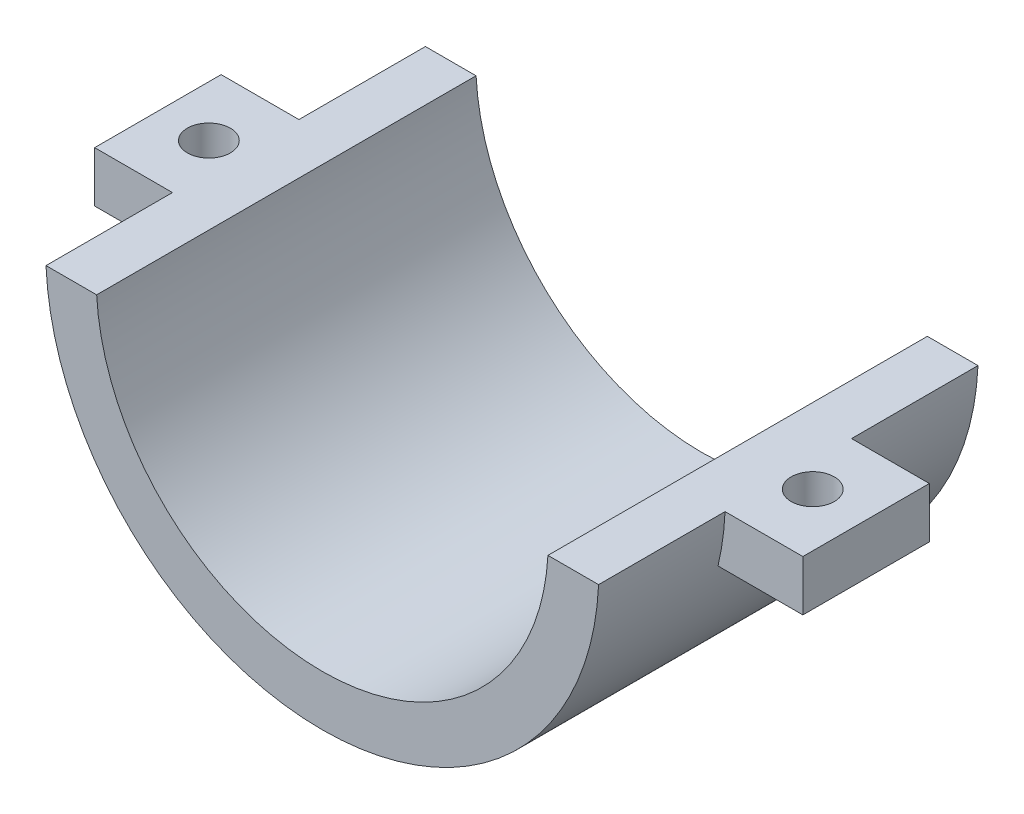
ISO-10303-21;
HEADER;
FILE_DESCRIPTION(('STEP AP214'),'2;1');
FILE_NAME('part.step','',(''),(''),'','','');
FILE_SCHEMA(('AUTOMOTIVE_DESIGN { 1 0 10303 214 1 1 1 1 }'));
ENDSEC;
DATA;
#1=APPLICATION_CONTEXT('core data for automotive mechanical design processes');
#2=APPLICATION_PROTOCOL_DEFINITION('international standard','automotive_design',2000,#1);
#3=PRODUCT_CONTEXT('',#1,'mechanical');
#4=PRODUCT('Part','Part','',(#3));
#5=PRODUCT_RELATED_PRODUCT_CATEGORY('part','',(#4));
#6=PRODUCT_DEFINITION_FORMATION('','',#4);
#7=PRODUCT_DEFINITION_CONTEXT('part definition',#1,'design');
#8=PRODUCT_DEFINITION('design','',#6,#7);
#9=PRODUCT_DEFINITION_SHAPE('','',#8);
#10=(LENGTH_UNIT() NAMED_UNIT(*) SI_UNIT(.MILLI.,.METRE.));
#11=(NAMED_UNIT(*) PLANE_ANGLE_UNIT() SI_UNIT($,.RADIAN.));
#12=(NAMED_UNIT(*) SI_UNIT($,.STERADIAN.) SOLID_ANGLE_UNIT());
#13=UNCERTAINTY_MEASURE_WITH_UNIT(LENGTH_MEASURE(1.E-05),#10,'distance_accuracy_value','');
#14=(GEOMETRIC_REPRESENTATION_CONTEXT(3) GLOBAL_UNCERTAINTY_ASSIGNED_CONTEXT((#13)) GLOBAL_UNIT_ASSIGNED_CONTEXT((#10,
#11,#12)) REPRESENTATION_CONTEXT('',''));
#15=CARTESIAN_POINT('',(0.,0.,0.));
#16=DIRECTION('',(0.,0.,1.));
#17=DIRECTION('',(1.,0.,0.));
#18=AXIS2_PLACEMENT_3D('',#15,#16,#17);
#19=CARTESIAN_POINT('',(0.,0.,-19.6210465312143));
#20=DIRECTION('',(0.,0.,-1.));
#21=DIRECTION('',(-1.,0.,0.));
#22=AXIS2_PLACEMENT_3D('',#19,#20,#21);
#23=CYLINDRICAL_SURFACE('',#22,21.87);
#24=CARTESIAN_POINT('',(0.,0.,-15.));
#25=DIRECTION('',(0.,0.,-1.));
#26=DIRECTION('',(-1.,0.,0.));
#27=AXIS2_PLACEMENT_3D('',#24,#25,#26);
#28=CIRCLE('',#27,21.87);
#29=CARTESIAN_POINT('',(21.8471256690669,-0.999999999999997,-15.));
#30=VERTEX_POINT('',#29);
#31=CARTESIAN_POINT('',(-21.8471256690669,-0.999999999999997,-15.));
#32=VERTEX_POINT('',#31);
#33=EDGE_CURVE('E206',#30,#32,#28,.T.);
#34=ORIENTED_EDGE('',*,*,#33,.F.);
#35=DIRECTION('',(0.,0.,-1.));
#36=VECTOR('',#35,1.);
#37=CARTESIAN_POINT('',(21.8471256690669,-0.999999999999997,-19.6210465312143));
#38=LINE('',#37,#36);
#39=CARTESIAN_POINT('',(21.8471256690669,-0.999999999999997,-5.));
#40=VERTEX_POINT('',#39);
#41=EDGE_CURVE('E286',#30,#40,#38,.F.);
#42=ORIENTED_EDGE('',*,*,#41,.T.);
#43=CARTESIAN_POINT('',(0.,0.,-5.));
#44=DIRECTION('',(0.,0.,1.));
#45=DIRECTION('',(1.,0.,0.));
#46=AXIS2_PLACEMENT_3D('',#43,#44,#45);
#47=CIRCLE('',#46,21.87);
#48=CARTESIAN_POINT('',(21.2907703007665,-4.99999999999999,-5.));
#49=VERTEX_POINT('',#48);
#50=EDGE_CURVE('E171',#40,#49,#47,.F.);
#51=ORIENTED_EDGE('',*,*,#50,.T.);
#52=DIRECTION('',(0.,0.,-1.));
#53=VECTOR('',#52,1.);
#54=CARTESIAN_POINT('',(21.2907703007665,-4.99999999999999,-19.6210465312143));
#55=LINE('',#54,#53);
#56=CARTESIAN_POINT('',(21.2907703007665,-4.99999999999999,4.99999999999999));
#57=VERTEX_POINT('',#56);
#58=EDGE_CURVE('E11',#57,#49,#55,.T.);
#59=ORIENTED_EDGE('',*,*,#58,.F.);
#60=CARTESIAN_POINT('',(0.,0.,4.99999999999999));
#61=DIRECTION('',(0.,0.,1.));
#62=DIRECTION('',(1.,0.,0.));
#63=AXIS2_PLACEMENT_3D('',#60,#61,#62);
#64=CIRCLE('',#63,21.87);
#65=CARTESIAN_POINT('',(21.8471256690669,-0.999999999999997,4.99999999999999));
#66=VERTEX_POINT('',#65);
#67=EDGE_CURVE('E168',#66,#57,#64,.F.);
#68=ORIENTED_EDGE('',*,*,#67,.F.);
#69=CARTESIAN_POINT('',(21.8471256690669,-0.999999999999997,15.));
#70=VERTEX_POINT('',#69);
#71=EDGE_CURVE('E64',#66,#70,#38,.F.);
#72=ORIENTED_EDGE('',*,*,#71,.T.);
#73=CARTESIAN_POINT('',(0.,0.,15.));
#74=DIRECTION('',(0.,0.,-1.));
#75=DIRECTION('',(-1.,0.,0.));
#76=AXIS2_PLACEMENT_3D('',#73,#74,#75);
#77=CIRCLE('',#76,21.87);
#78=CARTESIAN_POINT('',(-21.8471256690669,-0.999999999999997,15.));
#79=VERTEX_POINT('',#78);
#80=EDGE_CURVE('E202',#70,#79,#77,.T.);
#81=ORIENTED_EDGE('',*,*,#80,.T.);
#82=DIRECTION('',(0.,0.,-1.));
#83=VECTOR('',#82,1.);
#84=CARTESIAN_POINT('',(-21.8471256690669,-0.999999999999997,-19.6210465312143));
#85=LINE('',#84,#83);
#86=CARTESIAN_POINT('',(-21.8471256690669,-0.999999999999997,4.99999999999999));
#87=VERTEX_POINT('',#86);
#88=EDGE_CURVE('E228',#79,#87,#85,.T.);
#89=ORIENTED_EDGE('',*,*,#88,.T.);
#90=CARTESIAN_POINT('',(0.,0.,4.99999999999999));
#91=DIRECTION('',(0.,0.,-1.));
#92=DIRECTION('',(-1.,0.,0.));
#93=AXIS2_PLACEMENT_3D('',#90,#91,#92);
#94=CIRCLE('',#93,21.87);
#95=CARTESIAN_POINT('',(-21.2907703007665,-5.,4.99999999999999));
#96=VERTEX_POINT('',#95);
#97=EDGE_CURVE('E192',#87,#96,#94,.F.);
#98=ORIENTED_EDGE('',*,*,#97,.T.);
#99=DIRECTION('',(0.,0.,-1.));
#100=VECTOR('',#99,1.);
#101=CARTESIAN_POINT('',(-21.2907703007665,-5.,-19.6210465312143));
#102=LINE('',#101,#100);
#103=CARTESIAN_POINT('',(-21.2907703007665,-5.,-5.));
#104=VERTEX_POINT('',#103);
#105=EDGE_CURVE('E49',#104,#96,#102,.F.);
#106=ORIENTED_EDGE('',*,*,#105,.F.);
#107=CARTESIAN_POINT('',(0.,0.,-5.));
#108=DIRECTION('',(0.,0.,-1.));
#109=DIRECTION('',(-1.,0.,0.));
#110=AXIS2_PLACEMENT_3D('',#107,#108,#109);
#111=CIRCLE('',#110,21.87);
#112=CARTESIAN_POINT('',(-21.8471256690669,-0.999999999999997,-5.));
#113=VERTEX_POINT('',#112);
#114=EDGE_CURVE('E195',#113,#104,#111,.F.);
#115=ORIENTED_EDGE('',*,*,#114,.F.);
#116=EDGE_CURVE('E250',#113,#32,#85,.T.);
#117=ORIENTED_EDGE('',*,*,#116,.T.);
#118=EDGE_LOOP('',(#34,#42,#51,#59,#68,#72,#81,#89,#98,#106,#115,#117));
#119=FACE_BOUND('',#118,.T.);
#120=ADVANCED_FACE('F39',(#119),#23,.T.);
#121=CARTESIAN_POINT('',(0.,0.,-19.6210465312143));
#122=DIRECTION('',(0.,0.,-1.));
#123=DIRECTION('',(-1.,0.,0.));
#124=AXIS2_PLACEMENT_3D('',#121,#122,#123);
#125=CYLINDRICAL_SURFACE('',#124,17.87);
#126=CARTESIAN_POINT('',(0.,0.,15.));
#127=DIRECTION('',(0.,0.,-1.));
#128=DIRECTION('',(-1.,0.,0.));
#129=AXIS2_PLACEMENT_3D('',#126,#127,#128);
#130=CIRCLE('',#129,17.87);
#131=CARTESIAN_POINT('',(17.841998206479,-0.999999999999997,15.));
#132=VERTEX_POINT('',#131);
#133=CARTESIAN_POINT('',(-17.841998206479,-0.999999999999997,15.));
#134=VERTEX_POINT('',#133);
#135=EDGE_CURVE('E198',#132,#134,#130,.T.);
#136=ORIENTED_EDGE('',*,*,#135,.F.);
#137=DIRECTION('',(0.,0.,-1.));
#138=VECTOR('',#137,1.);
#139=CARTESIAN_POINT('',(17.841998206479,-0.999999999999997,-19.6210465312143));
#140=LINE('',#139,#138);
#141=CARTESIAN_POINT('',(17.841998206479,-0.999999999999997,-15.));
#142=VERTEX_POINT('',#141);
#143=EDGE_CURVE('E284',#132,#142,#140,.T.);
#144=ORIENTED_EDGE('',*,*,#143,.T.);
#145=CARTESIAN_POINT('',(0.,0.,-15.));
#146=DIRECTION('',(0.,0.,-1.));
#147=DIRECTION('',(-1.,0.,0.));
#148=AXIS2_PLACEMENT_3D('',#145,#146,#147);
#149=CIRCLE('',#148,17.87);
#150=CARTESIAN_POINT('',(-17.841998206479,-0.999999999999997,-15.));
#151=VERTEX_POINT('',#150);
#152=EDGE_CURVE('E210',#142,#151,#149,.T.);
#153=ORIENTED_EDGE('',*,*,#152,.T.);
#154=DIRECTION('',(0.,0.,-1.));
#155=VECTOR('',#154,1.);
#156=CARTESIAN_POINT('',(-17.841998206479,-0.999999999999997,-19.6210465312143));
#157=LINE('',#156,#155);
#158=EDGE_CURVE('E246',#151,#134,#157,.F.);
#159=ORIENTED_EDGE('',*,*,#158,.T.);
#160=EDGE_LOOP('',(#136,#144,#153,#159));
#161=FACE_BOUND('',#160,.T.);
#162=ADVANCED_FACE('F303',(#161),#125,.F.);
#163=CARTESIAN_POINT('',(21.87,1.52717393760999E-13,-15.));
#164=DIRECTION('',(0.,0.,-1.));
#165=DIRECTION('',(-1.,0.,0.));
#166=AXIS2_PLACEMENT_3D('',#163,#164,#165);
#167=PLANE('',#166);
#168=ORIENTED_EDGE('',*,*,#33,.T.);
#169=DIRECTION('',(1.,0.,0.));
#170=VECTOR('',#169,1.);
#171=CARTESIAN_POINT('',(21.87,-0.999999999999997,-15.));
#172=LINE('',#171,#170);
#173=EDGE_CURVE('E259',#32,#151,#172,.T.);
#174=ORIENTED_EDGE('',*,*,#173,.T.);
#175=ORIENTED_EDGE('',*,*,#152,.F.);
#176=EDGE_CURVE('E291',#142,#30,#172,.T.);
#177=ORIENTED_EDGE('',*,*,#176,.T.);
#178=EDGE_LOOP('',(#168,#174,#175,#177));
#179=FACE_BOUND('',#178,.T.);
#180=ADVANCED_FACE('F41',(#179),#167,.T.);
#181=CARTESIAN_POINT('',(21.87,1.52717393760999E-13,15.));
#182=DIRECTION('',(0.,0.,1.));
#183=DIRECTION('',(1.,0.,0.));
#184=AXIS2_PLACEMENT_3D('',#181,#182,#183);
#185=PLANE('',#184);
#186=ORIENTED_EDGE('',*,*,#80,.F.);
#187=DIRECTION('',(-1.,0.,0.));
#188=VECTOR('',#187,1.);
#189=CARTESIAN_POINT('',(21.87,-0.999999999999997,15.));
#190=LINE('',#189,#188);
#191=EDGE_CURVE('E248',#70,#132,#190,.T.);
#192=ORIENTED_EDGE('',*,*,#191,.T.);
#193=ORIENTED_EDGE('',*,*,#135,.T.);
#194=EDGE_CURVE('E241',#134,#79,#190,.T.);
#195=ORIENTED_EDGE('',*,*,#194,.T.);
#196=EDGE_LOOP('',(#186,#192,#193,#195));
#197=FACE_BOUND('',#196,.T.);
#198=ADVANCED_FACE('F306',(#197),#185,.T.);
#199=CARTESIAN_POINT('',(-28.,0.,-5.));
#200=DIRECTION('',(-1.,0.,0.));
#201=DIRECTION('',(0.,0.,1.));
#202=AXIS2_PLACEMENT_3D('',#199,#200,#201);
#203=PLANE('',#202);
#204=DIRECTION('',(0.,-1.,0.));
#205=VECTOR('',#204,1.);
#206=CARTESIAN_POINT('',(-28.,0.,4.99999999999999));
#207=LINE('',#206,#205);
#208=CARTESIAN_POINT('',(-28.,-0.999999999999997,4.99999999999999));
#209=VERTEX_POINT('',#208);
#210=CARTESIAN_POINT('',(-28.,-5.,4.99999999999999));
#211=VERTEX_POINT('',#210);
#212=EDGE_CURVE('E174',#209,#211,#207,.T.);
#213=ORIENTED_EDGE('',*,*,#212,.F.);
#214=DIRECTION('',(0.,0.,-1.));
#215=VECTOR('',#214,1.);
#216=CARTESIAN_POINT('',(-28.,-0.999999999999997,-5.));
#217=LINE('',#216,#215);
#218=CARTESIAN_POINT('',(-28.,-0.999999999999997,-5.));
#219=VERTEX_POINT('',#218);
#220=EDGE_CURVE('E56',#209,#219,#217,.T.);
#221=ORIENTED_EDGE('',*,*,#220,.T.);
#222=DIRECTION('',(0.,-1.,0.));
#223=VECTOR('',#222,1.);
#224=CARTESIAN_POINT('',(-28.,0.,-5.));
#225=LINE('',#224,#223);
#226=CARTESIAN_POINT('',(-28.,-5.,-5.));
#227=VERTEX_POINT('',#226);
#228=EDGE_CURVE('E181',#219,#227,#225,.T.);
#229=ORIENTED_EDGE('',*,*,#228,.T.);
#230=DIRECTION('',(0.,0.,1.));
#231=VECTOR('',#230,1.);
#232=CARTESIAN_POINT('',(-28.,-5.,-5.));
#233=LINE('',#232,#231);
#234=EDGE_CURVE('E188',#227,#211,#233,.T.);
#235=ORIENTED_EDGE('',*,*,#234,.T.);
#236=EDGE_LOOP('',(#213,#221,#229,#235));
#237=FACE_BOUND('',#236,.T.);
#238=ADVANCED_FACE('F234',(#237),#203,.T.);
#239=CARTESIAN_POINT('',(0.,0.,-5.));
#240=DIRECTION('',(0.,0.,-1.));
#241=DIRECTION('',(-1.,0.,0.));
#242=AXIS2_PLACEMENT_3D('',#239,#240,#241);
#243=PLANE('',#242);
#244=ORIENTED_EDGE('',*,*,#228,.F.);
#245=DIRECTION('',(1.,0.,0.));
#246=VECTOR('',#245,1.);
#247=CARTESIAN_POINT('',(0.,-0.999999999999997,-5.));
#248=LINE('',#247,#246);
#249=EDGE_CURVE('E239',#219,#113,#248,.T.);
#250=ORIENTED_EDGE('',*,*,#249,.T.);
#251=ORIENTED_EDGE('',*,*,#114,.T.);
#252=DIRECTION('',(1.,0.,0.));
#253=VECTOR('',#252,1.);
#254=CARTESIAN_POINT('',(-19.87,-5.,-5.));
#255=LINE('',#254,#253);
#256=EDGE_CURVE('E184',#227,#104,#255,.T.);
#257=ORIENTED_EDGE('',*,*,#256,.F.);
#258=EDGE_LOOP('',(#244,#250,#251,#257));
#259=FACE_BOUND('',#258,.T.);
#260=ADVANCED_FACE('F237',(#259),#243,.T.);
#261=CARTESIAN_POINT('',(0.,0.,4.99999999999999));
#262=DIRECTION('',(0.,0.,-1.));
#263=DIRECTION('',(-1.,0.,0.));
#264=AXIS2_PLACEMENT_3D('',#261,#262,#263);
#265=PLANE('',#264);
#266=DIRECTION('',(1.,0.,0.));
#267=VECTOR('',#266,1.);
#268=CARTESIAN_POINT('',(0.,-0.999999999999997,4.99999999999999));
#269=LINE('',#268,#267);
#270=EDGE_CURVE('E232',#209,#87,#269,.T.);
#271=ORIENTED_EDGE('',*,*,#270,.F.);
#272=ORIENTED_EDGE('',*,*,#212,.T.);
#273=DIRECTION('',(1.,0.,0.));
#274=VECTOR('',#273,1.);
#275=CARTESIAN_POINT('',(-19.87,-5.,4.99999999999999));
#276=LINE('',#275,#274);
#277=EDGE_CURVE('E177',#211,#96,#276,.T.);
#278=ORIENTED_EDGE('',*,*,#277,.T.);
#279=ORIENTED_EDGE('',*,*,#97,.F.);
#280=EDGE_LOOP('',(#271,#272,#278,#279));
#281=FACE_BOUND('',#280,.T.);
#282=ADVANCED_FACE('F230',(#281),#265,.F.);
#283=CARTESIAN_POINT('',(28.,0.,-5.));
#284=DIRECTION('',(1.,0.,0.));
#285=DIRECTION('',(0.,0.,-1.));
#286=AXIS2_PLACEMENT_3D('',#283,#284,#285);
#287=PLANE('',#286);
#288=DIRECTION('',(0.,1.,0.));
#289=VECTOR('',#288,1.);
#290=CARTESIAN_POINT('',(28.,0.,-5.));
#291=LINE('',#290,#289);
#292=CARTESIAN_POINT('',(28.,-4.99999999999999,-5.));
#293=VERTEX_POINT('',#292);
#294=CARTESIAN_POINT('',(28.,-0.999999999999997,-5.));
#295=VERTEX_POINT('',#294);
#296=EDGE_CURVE('E146',#293,#295,#291,.T.);
#297=ORIENTED_EDGE('',*,*,#296,.T.);
#298=DIRECTION('',(0.,0.,1.));
#299=VECTOR('',#298,1.);
#300=CARTESIAN_POINT('',(28.,-0.999999999999997,-5.));
#301=LINE('',#300,#299);
#302=CARTESIAN_POINT('',(28.,-0.999999999999997,4.99999999999999));
#303=VERTEX_POINT('',#302);
#304=EDGE_CURVE('E131',#295,#303,#301,.T.);
#305=ORIENTED_EDGE('',*,*,#304,.T.);
#306=DIRECTION('',(0.,1.,0.));
#307=VECTOR('',#306,1.);
#308=CARTESIAN_POINT('',(28.,0.,4.99999999999999));
#309=LINE('',#308,#307);
#310=CARTESIAN_POINT('',(28.,-4.99999999999999,4.99999999999999));
#311=VERTEX_POINT('',#310);
#312=EDGE_CURVE('E144',#311,#303,#309,.T.);
#313=ORIENTED_EDGE('',*,*,#312,.F.);
#314=DIRECTION('',(0.,0.,1.));
#315=VECTOR('',#314,1.);
#316=CARTESIAN_POINT('',(28.,-4.99999999999999,-5.));
#317=LINE('',#316,#315);
#318=EDGE_CURVE('E165',#293,#311,#317,.T.);
#319=ORIENTED_EDGE('',*,*,#318,.F.);
#320=EDGE_LOOP('',(#297,#305,#313,#319));
#321=FACE_BOUND('',#320,.T.);
#322=ADVANCED_FACE('F142',(#321),#287,.T.);
#323=CARTESIAN_POINT('',(0.,0.,-5.));
#324=DIRECTION('',(0.,0.,1.));
#325=DIRECTION('',(1.,0.,0.));
#326=AXIS2_PLACEMENT_3D('',#323,#324,#325);
#327=PLANE('',#326);
#328=DIRECTION('',(-1.,0.,0.));
#329=VECTOR('',#328,1.);
#330=CARTESIAN_POINT('',(0.,-0.999999999999997,-5.));
#331=LINE('',#330,#329);
#332=EDGE_CURVE('E277',#295,#40,#331,.T.);
#333=ORIENTED_EDGE('',*,*,#332,.F.);
#334=ORIENTED_EDGE('',*,*,#296,.F.);
#335=DIRECTION('',(1.,0.,0.));
#336=VECTOR('',#335,1.);
#337=CARTESIAN_POINT('',(19.87,-4.99999999999999,-5.));
#338=LINE('',#337,#336);
#339=EDGE_CURVE('E154',#49,#293,#338,.T.);
#340=ORIENTED_EDGE('',*,*,#339,.F.);
#341=ORIENTED_EDGE('',*,*,#50,.F.);
#342=EDGE_LOOP('',(#333,#334,#340,#341));
#343=FACE_BOUND('',#342,.T.);
#344=ADVANCED_FACE('F275',(#343),#327,.F.);
#345=CARTESIAN_POINT('',(0.,0.,4.99999999999999));
#346=DIRECTION('',(0.,0.,1.));
#347=DIRECTION('',(1.,0.,0.));
#348=AXIS2_PLACEMENT_3D('',#345,#346,#347);
#349=PLANE('',#348);
#350=ORIENTED_EDGE('',*,*,#312,.T.);
#351=DIRECTION('',(-1.,0.,0.));
#352=VECTOR('',#351,1.);
#353=CARTESIAN_POINT('',(0.,-0.999999999999997,4.99999999999999));
#354=LINE('',#353,#352);
#355=EDGE_CURVE('E127',#303,#66,#354,.T.);
#356=ORIENTED_EDGE('',*,*,#355,.T.);
#357=ORIENTED_EDGE('',*,*,#67,.T.);
#358=DIRECTION('',(1.,0.,0.));
#359=VECTOR('',#358,1.);
#360=CARTESIAN_POINT('',(19.87,-4.99999999999999,4.99999999999999));
#361=LINE('',#360,#359);
#362=EDGE_CURVE('E151',#57,#311,#361,.T.);
#363=ORIENTED_EDGE('',*,*,#362,.T.);
#364=EDGE_LOOP('',(#350,#356,#357,#363));
#365=FACE_BOUND('',#364,.T.);
#366=ADVANCED_FACE('F149',(#365),#349,.T.);
#367=CARTESIAN_POINT('',(23.7782771535581,0.,0.));
#368=DIRECTION('',(0.,1.,0.));
#369=DIRECTION('',(0.,0.,1.));
#370=AXIS2_PLACEMENT_3D('',#367,#368,#369);
#371=CYLINDRICAL_SURFACE('',#370,1.69999999999999);
#372=CARTESIAN_POINT('',(23.7782771535581,-4.99999999999999,0.));
#373=DIRECTION('',(0.,-1.,0.));
#374=DIRECTION('',(1.,0.,0.));
#375=AXIS2_PLACEMENT_3D('',#372,#373,#374);
#376=CIRCLE('',#375,1.69999999999999);
#377=CARTESIAN_POINT('',(25.4782771535581,-4.99999999999999,0.));
#378=VERTEX_POINT('',#377);
#379=EDGE_CURVE('E159',#378,#378,#376,.T.);
#380=ORIENTED_EDGE('',*,*,#379,.T.);
#381=EDGE_LOOP('',(#380));
#382=FACE_BOUND('',#381,.T.);
#383=CARTESIAN_POINT('',(23.7782771535581,-0.999999999999997,0.));
#384=DIRECTION('',(0.,1.,0.));
#385=DIRECTION('',(0.,0.,1.));
#386=AXIS2_PLACEMENT_3D('',#383,#384,#385);
#387=CIRCLE('',#386,1.69999999999999);
#388=CARTESIAN_POINT('',(23.7782771535581,-0.999999999999997,1.69999999999999));
#389=VERTEX_POINT('',#388);
#390=EDGE_CURVE('E137',#389,#389,#387,.F.);
#391=ORIENTED_EDGE('',*,*,#390,.F.);
#392=EDGE_LOOP('',(#391));
#393=FACE_BOUND('',#392,.T.);
#394=ADVANCED_FACE('F264',(#382,#393),#371,.F.);
#395=CARTESIAN_POINT('',(-23.9700374531835,0.,0.));
#396=DIRECTION('',(0.,1.,0.));
#397=DIRECTION('',(0.,0.,1.));
#398=AXIS2_PLACEMENT_3D('',#395,#396,#397);
#399=CYLINDRICAL_SURFACE('',#398,1.69999999999999);
#400=CARTESIAN_POINT('',(-23.9700374531835,-5.,0.));
#401=DIRECTION('',(0.,-1.,0.));
#402=DIRECTION('',(1.,0.,0.));
#403=AXIS2_PLACEMENT_3D('',#400,#401,#402);
#404=CIRCLE('',#403,1.69999999999999);
#405=CARTESIAN_POINT('',(-22.2700374531835,-5.,0.));
#406=VERTEX_POINT('',#405);
#407=EDGE_CURVE('E256',#406,#406,#404,.T.);
#408=ORIENTED_EDGE('',*,*,#407,.T.);
#409=EDGE_LOOP('',(#408));
#410=FACE_BOUND('',#409,.T.);
#411=CARTESIAN_POINT('',(-23.9700374531835,-0.999999999999997,0.));
#412=DIRECTION('',(0.,1.,0.));
#413=DIRECTION('',(0.,0.,1.));
#414=AXIS2_PLACEMENT_3D('',#411,#412,#413);
#415=CIRCLE('',#414,1.69999999999999);
#416=CARTESIAN_POINT('',(-23.9700374531835,-0.999999999999997,1.69999999999999));
#417=VERTEX_POINT('',#416);
#418=EDGE_CURVE('E43',#417,#417,#415,.F.);
#419=ORIENTED_EDGE('',*,*,#418,.F.);
#420=EDGE_LOOP('',(#419));
#421=FACE_BOUND('',#420,.T.);
#422=ADVANCED_FACE('F321',(#410,#421),#399,.F.);
#423=CARTESIAN_POINT('',(-19.87,-5.,-5.));
#424=DIRECTION('',(0.,-1.,0.));
#425=DIRECTION('',(1.,0.,0.));
#426=AXIS2_PLACEMENT_3D('',#423,#424,#425);
#427=PLANE('',#426);
#428=ORIENTED_EDGE('',*,*,#407,.F.);
#429=EDGE_LOOP('',(#428));
#430=FACE_BOUND('',#429,.T.);
#431=ORIENTED_EDGE('',*,*,#256,.T.);
#432=ORIENTED_EDGE('',*,*,#105,.T.);
#433=ORIENTED_EDGE('',*,*,#277,.F.);
#434=ORIENTED_EDGE('',*,*,#234,.F.);
#435=EDGE_LOOP('',(#431,#432,#433,#434));
#436=FACE_BOUND('',#435,.T.);
#437=ADVANCED_FACE('F219',(#430,#436),#427,.T.);
#438=CARTESIAN_POINT('',(19.87,-4.99999999999999,-5.));
#439=DIRECTION('',(0.,-1.,0.));
#440=DIRECTION('',(1.,0.,0.));
#441=AXIS2_PLACEMENT_3D('',#438,#439,#440);
#442=PLANE('',#441);
#443=ORIENTED_EDGE('',*,*,#379,.F.);
#444=EDGE_LOOP('',(#443));
#445=FACE_BOUND('',#444,.T.);
#446=ORIENTED_EDGE('',*,*,#362,.F.);
#447=ORIENTED_EDGE('',*,*,#58,.T.);
#448=ORIENTED_EDGE('',*,*,#339,.T.);
#449=ORIENTED_EDGE('',*,*,#318,.T.);
#450=EDGE_LOOP('',(#446,#447,#448,#449));
#451=FACE_BOUND('',#450,.T.);
#452=ADVANCED_FACE('F267',(#445,#451),#442,.T.);
#453=CARTESIAN_POINT('',(0.,-0.999999999999997,0.));
#454=DIRECTION('',(0.,1.,0.));
#455=DIRECTION('',(0.,0.,1.));
#456=AXIS2_PLACEMENT_3D('',#453,#454,#455);
#457=PLANE('',#456);
#458=ORIENTED_EDGE('',*,*,#116,.F.);
#459=ORIENTED_EDGE('',*,*,#249,.F.);
#460=ORIENTED_EDGE('',*,*,#220,.F.);
#461=ORIENTED_EDGE('',*,*,#270,.T.);
#462=ORIENTED_EDGE('',*,*,#88,.F.);
#463=ORIENTED_EDGE('',*,*,#194,.F.);
#464=ORIENTED_EDGE('',*,*,#158,.F.);
#465=ORIENTED_EDGE('',*,*,#173,.F.);
#466=EDGE_LOOP('',(#458,#459,#460,#461,#462,#463,#464,#465));
#467=FACE_BOUND('',#466,.T.);
#468=ORIENTED_EDGE('',*,*,#418,.T.);
#469=EDGE_LOOP('',(#468));
#470=FACE_BOUND('',#469,.T.);
#471=ADVANCED_FACE('F270',(#467,#470),#457,.T.);
#472=ORIENTED_EDGE('',*,*,#143,.F.);
#473=ORIENTED_EDGE('',*,*,#191,.F.);
#474=ORIENTED_EDGE('',*,*,#71,.F.);
#475=ORIENTED_EDGE('',*,*,#355,.F.);
#476=ORIENTED_EDGE('',*,*,#304,.F.);
#477=ORIENTED_EDGE('',*,*,#332,.T.);
#478=ORIENTED_EDGE('',*,*,#41,.F.);
#479=ORIENTED_EDGE('',*,*,#176,.F.);
#480=EDGE_LOOP('',(#472,#473,#474,#475,#476,#477,#478,#479));
#481=FACE_BOUND('',#480,.T.);
#482=ORIENTED_EDGE('',*,*,#390,.T.);
#483=EDGE_LOOP('',(#482));
#484=FACE_BOUND('',#483,.T.);
#485=ADVANCED_FACE('F129',(#481,#484),#457,.T.);
#486=CLOSED_SHELL('',(#120,#162,#180,#198,#238,#260,#282,#322,#344,#366,#394,#422,#437,#452,
#471,#485));
#487=MANIFOLD_SOLID_BREP('B2',#486);
#488=ADVANCED_BREP_SHAPE_REPRESENTATION('',(#18,#487),#14);
#489=SHAPE_DEFINITION_REPRESENTATION(#9,#488);
ENDSEC;
END-ISO-10303-21;
